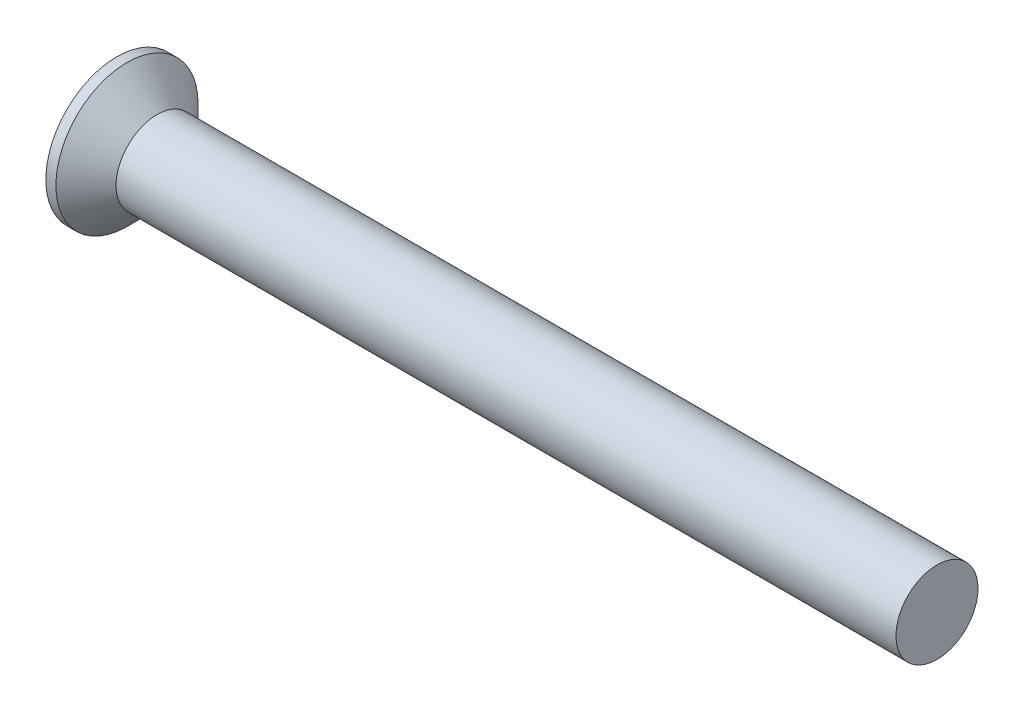
ISO-10303-21;
HEADER;
FILE_DESCRIPTION(('STEP AP214'),'2;1');
FILE_NAME('part.step','',(''),(''),'','','');
FILE_SCHEMA(('AUTOMOTIVE_DESIGN { 1 0 10303 214 1 1 1 1 }'));
ENDSEC;
DATA;
#1=APPLICATION_CONTEXT('core data for automotive mechanical design processes');
#2=APPLICATION_PROTOCOL_DEFINITION('international standard','automotive_design',2000,#1);
#3=PRODUCT_CONTEXT('',#1,'mechanical');
#4=PRODUCT('Part','Part','',(#3));
#5=PRODUCT_RELATED_PRODUCT_CATEGORY('part','',(#4));
#6=PRODUCT_DEFINITION_FORMATION('','',#4);
#7=PRODUCT_DEFINITION_CONTEXT('part definition',#1,'design');
#8=PRODUCT_DEFINITION('design','',#6,#7);
#9=PRODUCT_DEFINITION_SHAPE('','',#8);
#10=(LENGTH_UNIT() NAMED_UNIT(*) SI_UNIT(.MILLI.,.METRE.));
#11=(NAMED_UNIT(*) PLANE_ANGLE_UNIT() SI_UNIT($,.RADIAN.));
#12=(NAMED_UNIT(*) SI_UNIT($,.STERADIAN.) SOLID_ANGLE_UNIT());
#13=UNCERTAINTY_MEASURE_WITH_UNIT(LENGTH_MEASURE(1.E-05),#10,'distance_accuracy_value','');
#14=(GEOMETRIC_REPRESENTATION_CONTEXT(3) GLOBAL_UNCERTAINTY_ASSIGNED_CONTEXT((#13)) GLOBAL_UNIT_ASSIGNED_CONTEXT((#10,
#11,#12)) REPRESENTATION_CONTEXT('',''));
#15=CARTESIAN_POINT('',(0.,0.,0.));
#16=DIRECTION('',(0.,0.,1.));
#17=DIRECTION('',(1.,0.,0.));
#18=AXIS2_PLACEMENT_3D('',#15,#16,#17);
#19=CARTESIAN_POINT('',(30.,1.5,0.));
#20=DIRECTION('',(1.,0.,0.));
#21=DIRECTION('',(0.,0.,-1.));
#22=AXIS2_PLACEMENT_3D('',#19,#20,#21);
#23=PLANE('',#22);
#24=CARTESIAN_POINT('',(30.,0.,0.));
#25=DIRECTION('',(1.,0.,0.));
#26=DIRECTION('',(0.,0.,-1.));
#27=AXIS2_PLACEMENT_3D('',#24,#25,#26);
#28=CIRCLE('',#27,1.5);
#29=CARTESIAN_POINT('',(30.,0.,-1.5));
#30=VERTEX_POINT('',#29);
#31=EDGE_CURVE('E212',#30,#30,#28,.T.);
#32=ORIENTED_EDGE('',*,*,#31,.T.);
#33=EDGE_LOOP('',(#32));
#34=FACE_BOUND('',#33,.T.);
#35=ADVANCED_FACE('F39',(#34),#23,.T.);
#36=CARTESIAN_POINT('',(4.47857142857143,0.,0.));
#37=DIRECTION('',(0.,0.,1.));
#38=DIRECTION('',(1.,0.,0.));
#39=AXIS2_PLACEMENT_3D('',#36,#37,#38);
#40=SPHERICAL_SURFACE('',#39,5.17857142857143);
#41=CARTESIAN_POINT('',(4.47857142857143,-0.34,0.));
#42=DIRECTION('',(0.,-1.,0.));
#43=DIRECTION('',(0.,0.,-1.));
#44=AXIS2_PLACEMENT_3D('',#41,#42,#43);
#45=CIRCLE('',#44,5.16739799520187);
#46=CARTESIAN_POINT('',(-0.649040300178744,-0.34,0.64));
#47=VERTEX_POINT('',#46);
#48=CARTESIAN_POINT('',(-0.449236221463888,-0.34,1.55522146495917));
#49=VERTEX_POINT('',#48);
#50=EDGE_CURVE('E216',#47,#49,#45,.F.);
#51=ORIENTED_EDGE('',*,*,#50,.F.);
#52=CARTESIAN_POINT('',(-0.649040300178744,-0.34,0.64));
#53=CARTESIAN_POINT('',(-0.651125092654162,-0.339985289450023,0.623311452140583));
#54=CARTESIAN_POINT('',(-0.653033929290357,-0.341391829430021,0.606601424650036));
#55=CARTESIAN_POINT('',(-0.656452170050109,-0.346964127621354,0.5736121624894));
#56=CARTESIAN_POINT('',(-0.65796171829767,-0.351128888339867,0.557332774293918));
#57=CARTESIAN_POINT('',(-0.660536487111277,-0.362138947374793,0.525652873141929));
#58=CARTESIAN_POINT('',(-0.661601343834687,-0.368986431829208,0.510253088726624));
#59=CARTESIAN_POINT('',(-0.663252998096254,-0.385171176182099,0.480800931998128));
#60=CARTESIAN_POINT('',(-0.663839957231516,-0.394507593050013,0.466748105641541));
#61=CARTESIAN_POINT('',(-0.664515452071122,-0.415321472159786,0.4405062565739));
#62=CARTESIAN_POINT('',(-0.664608082666448,-0.426780527999705,0.428302737690038));
#63=CARTESIAN_POINT('',(-0.664303114987313,-0.451564797074484,0.405969181412248));
#64=CARTESIAN_POINT('',(-0.663905445161817,-0.464890282431521,0.395839446903564));
#65=CARTESIAN_POINT('',(-0.662634307516275,-0.492968256658572,0.37797394516552));
#66=CARTESIAN_POINT('',(-0.661762583572712,-0.507715353336348,0.370229565624028));
#67=CARTESIAN_POINT('',(-0.659570189800754,-0.538256524979789,0.357293431751204));
#68=CARTESIAN_POINT('',(-0.658249676480978,-0.554050233411554,0.352100789081599));
#69=CARTESIAN_POINT('',(-0.655638949519575,-0.58159529125856,0.345503933478422));
#70=CARTESIAN_POINT('',(-0.654449232328966,-0.593202962798242,0.343439686525628));
#71=CARTESIAN_POINT('',(-0.65188165405693,-0.616542796288321,0.34068755770359));
#72=CARTESIAN_POINT('',(-0.650504065142036,-0.628274755914445,0.339997706931737));
#73=CARTESIAN_POINT('',(-0.649040300178744,-0.64,0.34));
#74=B_SPLINE_CURVE_WITH_KNOTS('',3,(#52,#53,#54,#55,#56,#57,#58,#59,#60,#61,#62,#63,#64,#65,#66,
#67,#68,#69,#70,#71,#72,#73),.UNSPECIFIED.,.F.,.F.,(4,2,2,2,2,2,2,2,2,2,4),(0.,
0.0503945846133996,0.100770954293446,0.151188461094855,0.201588912545959,0.251571204016887,
0.301560790419327,0.351367714764633,0.401157287478689,0.436628333814892,0.472048529167462),.UNSPECIFIED.);
#75=CARTESIAN_POINT('',(-0.649040300178744,-0.64,0.34));
#76=VERTEX_POINT('',#75);
#77=EDGE_CURVE('E271',#47,#76,#74,.T.);
#78=ORIENTED_EDGE('',*,*,#77,.T.);
#79=CARTESIAN_POINT('',(4.47857142857143,0.,0.34));
#80=DIRECTION('',(0.,0.,1.));
#81=DIRECTION('',(1.,0.,0.));
#82=AXIS2_PLACEMENT_3D('',#79,#80,#81);
#83=CIRCLE('',#82,5.16739799520187);
#84=CARTESIAN_POINT('',(-0.449236221463888,-1.55522146495917,0.34));
#85=VERTEX_POINT('',#84);
#86=EDGE_CURVE('E190',#85,#76,#83,.F.);
#87=ORIENTED_EDGE('',*,*,#86,.F.);
#88=CARTESIAN_POINT('',(3.92005016464534,0.967387206227569,0.));
#89=DIRECTION('',(-0.500000000000001,0.866025403784438,0.));
#90=DIRECTION('',(-0.866025403784438,-0.500000000000001,0.));
#91=AXIS2_PLACEMENT_3D('',#88,#89,#90);
#92=CIRCLE('',#91,5.05666075901735);
#93=CARTESIAN_POINT('',(-0.449236221463888,-1.55522146495917,-0.339999999999999));
#94=VERTEX_POINT('',#93);
#95=EDGE_CURVE('E228',#94,#85,#92,.T.);
#96=ORIENTED_EDGE('',*,*,#95,.F.);
#97=CARTESIAN_POINT('',(4.47857142857143,0.,-0.34));
#98=DIRECTION('',(0.,0.,-1.));
#99=DIRECTION('',(0.,1.,0.));
#100=AXIS2_PLACEMENT_3D('',#97,#98,#99);
#101=CIRCLE('',#100,5.16739799520187);
#102=CARTESIAN_POINT('',(-0.649040300178744,-0.64,-0.34));
#103=VERTEX_POINT('',#102);
#104=EDGE_CURVE('E184',#103,#94,#101,.F.);
#105=ORIENTED_EDGE('',*,*,#104,.F.);
#106=CARTESIAN_POINT('',(-0.649040300178744,-0.64,-0.34));
#107=CARTESIAN_POINT('',(-0.651125092654162,-0.623311452140583,-0.339985289450022));
#108=CARTESIAN_POINT('',(-0.653033929290357,-0.606601424650036,-0.34139182943002));
#109=CARTESIAN_POINT('',(-0.656452170050109,-0.5736121624894,-0.346964127621354));
#110=CARTESIAN_POINT('',(-0.65796171829767,-0.557332774293918,-0.351128888339867));
#111=CARTESIAN_POINT('',(-0.660536487111277,-0.525652873141929,-0.362138947374792));
#112=CARTESIAN_POINT('',(-0.661601343834687,-0.510253088726624,-0.368986431829208));
#113=CARTESIAN_POINT('',(-0.663252998096254,-0.480800931998128,-0.385171176182099));
#114=CARTESIAN_POINT('',(-0.663839957231516,-0.466748105641541,-0.394507593050013));
#115=CARTESIAN_POINT('',(-0.664515452071122,-0.4405062565739,-0.415321472159785));
#116=CARTESIAN_POINT('',(-0.664608082666448,-0.428302737690037,-0.426780527999705));
#117=CARTESIAN_POINT('',(-0.664303114987313,-0.405969181412248,-0.451564797074484));
#118=CARTESIAN_POINT('',(-0.663905445161817,-0.395839446903564,-0.464890282431521));
#119=CARTESIAN_POINT('',(-0.662634307516275,-0.37797394516552,-0.492968256658571));
#120=CARTESIAN_POINT('',(-0.661762583572712,-0.370229565624028,-0.507715353336347));
#121=CARTESIAN_POINT('',(-0.659570189800754,-0.357293431751204,-0.538256524979788));
#122=CARTESIAN_POINT('',(-0.658249676480978,-0.352100789081599,-0.554050233411553));
#123=CARTESIAN_POINT('',(-0.655638949519575,-0.345503933478422,-0.581595291258559));
#124=CARTESIAN_POINT('',(-0.654449232328966,-0.343439686525628,-0.593202962798242));
#125=CARTESIAN_POINT('',(-0.651881654056929,-0.34068755770359,-0.61654279628832));
#126=CARTESIAN_POINT('',(-0.650504065142036,-0.339997706931737,-0.628274755914444));
#127=CARTESIAN_POINT('',(-0.649040300178744,-0.34,-0.64));
#128=B_SPLINE_CURVE_WITH_KNOTS('',3,(#106,#107,#108,#109,#110,#111,#112,#113,#114,#115,#116,
#117,#118,#119,#120,#121,#122,#123,#124,#125,#126,#127),.UNSPECIFIED.,.F.,.F.,(4,2,2,2,2,2,2,2,
2,2,4),(0.,0.0503945846133996,0.100770954293446,0.151188461094856,0.201588912545959,
0.251571204016887,0.301560790419327,0.351367714764633,0.401157287478689,0.436628333814892,
0.472048529167462),.UNSPECIFIED.);
#129=CARTESIAN_POINT('',(-0.649040300178744,-0.34,-0.64));
#130=VERTEX_POINT('',#129);
#131=EDGE_CURVE('E265',#103,#130,#128,.T.);
#132=ORIENTED_EDGE('',*,*,#131,.T.);
#133=CARTESIAN_POINT('',(4.47857142857143,-0.34,0.));
#134=DIRECTION('',(0.,-1.,0.));
#135=DIRECTION('',(0.,0.,-1.));
#136=AXIS2_PLACEMENT_3D('',#133,#134,#135);
#137=CIRCLE('',#136,5.16739799520187);
#138=CARTESIAN_POINT('',(-0.449236221463888,-0.34,-1.55522146495917));
#139=VERTEX_POINT('',#138);
#140=EDGE_CURVE('E181',#139,#130,#137,.F.);
#141=ORIENTED_EDGE('',*,*,#140,.F.);
#142=CARTESIAN_POINT('',(3.92005016464534,0.,0.967387206227569));
#143=DIRECTION('',(-0.500000000000001,0.,0.866025403784438));
#144=DIRECTION('',(0.866025403784438,0.,0.500000000000001));
#145=AXIS2_PLACEMENT_3D('',#142,#143,#144);
#146=CIRCLE('',#145,5.05666075901735);
#147=CARTESIAN_POINT('',(-0.449236221463888,0.34,-1.55522146495917));
#148=VERTEX_POINT('',#147);
#149=EDGE_CURVE('E169',#148,#139,#146,.T.);
#150=ORIENTED_EDGE('',*,*,#149,.F.);
#151=CARTESIAN_POINT('',(4.47857142857143,0.34,0.));
#152=DIRECTION('',(0.,1.,0.));
#153=DIRECTION('',(0.,0.,1.));
#154=AXIS2_PLACEMENT_3D('',#151,#152,#153);
#155=CIRCLE('',#154,5.16739799520187);
#156=CARTESIAN_POINT('',(-0.649040300178744,0.34,-0.64));
#157=VERTEX_POINT('',#156);
#158=EDGE_CURVE('E154',#157,#148,#155,.F.);
#159=ORIENTED_EDGE('',*,*,#158,.F.);
#160=CARTESIAN_POINT('',(-0.649040300178744,0.34,-0.64));
#161=CARTESIAN_POINT('',(-0.651125092654162,0.339985289450023,-0.623311452140583));
#162=CARTESIAN_POINT('',(-0.653033929290357,0.34139182943002,-0.606601424650036));
#163=CARTESIAN_POINT('',(-0.656452170050109,0.346964127621354,-0.5736121624894));
#164=CARTESIAN_POINT('',(-0.65796171829767,0.351128888339867,-0.557332774293918));
#165=CARTESIAN_POINT('',(-0.660536487111277,0.362138947374792,-0.525652873141928));
#166=CARTESIAN_POINT('',(-0.661601343834687,0.368986431829208,-0.510253088726624));
#167=CARTESIAN_POINT('',(-0.663252998096254,0.385171176182099,-0.480800931998128));
#168=CARTESIAN_POINT('',(-0.663839957231516,0.394507593050013,-0.466748105641541));
#169=CARTESIAN_POINT('',(-0.664515452071122,0.415321472159785,-0.4405062565739));
#170=CARTESIAN_POINT('',(-0.664608082666448,0.426780527999705,-0.428302737690037));
#171=CARTESIAN_POINT('',(-0.664303114987313,0.451564797074484,-0.405969181412247));
#172=CARTESIAN_POINT('',(-0.663905445161817,0.464890282431521,-0.395839446903564));
#173=CARTESIAN_POINT('',(-0.662634307516275,0.492968256658572,-0.37797394516552));
#174=CARTESIAN_POINT('',(-0.661762583572712,0.507715353336347,-0.370229565624028));
#175=CARTESIAN_POINT('',(-0.659570189800754,0.538256524979789,-0.357293431751204));
#176=CARTESIAN_POINT('',(-0.658249676480978,0.554050233411553,-0.352100789081598));
#177=CARTESIAN_POINT('',(-0.655638949519575,0.581595291258559,-0.345503933478422));
#178=CARTESIAN_POINT('',(-0.654449232328966,0.593202962798242,-0.343439686525628));
#179=CARTESIAN_POINT('',(-0.651881654056929,0.616542796288321,-0.34068755770359));
#180=CARTESIAN_POINT('',(-0.650504065142036,0.628274755914444,-0.339997706931736));
#181=CARTESIAN_POINT('',(-0.649040300178744,0.64,-0.34));
#182=B_SPLINE_CURVE_WITH_KNOTS('',3,(#160,#161,#162,#163,#164,#165,#166,#167,#168,#169,#170,
#171,#172,#173,#174,#175,#176,#177,#178,#179,#180,#181),.UNSPECIFIED.,.F.,.F.,(4,2,2,2,2,2,2,2,
2,2,4),(0.,0.0503945846133996,0.100770954293446,0.151188461094856,0.201588912545959,
0.251571204016887,0.301560790419327,0.351367714764633,0.401157287478689,0.436628333814892,
0.472048529167462),.UNSPECIFIED.);
#183=CARTESIAN_POINT('',(-0.649040300178744,0.64,-0.34));
#184=VERTEX_POINT('',#183);
#185=EDGE_CURVE('E248',#157,#184,#182,.T.);
#186=ORIENTED_EDGE('',*,*,#185,.T.);
#187=CARTESIAN_POINT('',(4.47857142857143,0.,-0.34));
#188=DIRECTION('',(0.,0.,-1.));
#189=DIRECTION('',(0.,1.,0.));
#190=AXIS2_PLACEMENT_3D('',#187,#188,#189);
#191=CIRCLE('',#190,5.16739799520187);
#192=CARTESIAN_POINT('',(-0.449236221463888,1.55522146495917,-0.34));
#193=VERTEX_POINT('',#192);
#194=EDGE_CURVE('E165',#193,#184,#191,.F.);
#195=ORIENTED_EDGE('',*,*,#194,.F.);
#196=CARTESIAN_POINT('',(3.92005016464534,-0.967387206227569,0.));
#197=DIRECTION('',(-0.500000000000001,-0.866025403784438,0.));
#198=DIRECTION('',(0.866025403784438,-0.500000000000001,0.));
#199=AXIS2_PLACEMENT_3D('',#196,#197,#198);
#200=CIRCLE('',#199,5.05666075901735);
#201=CARTESIAN_POINT('',(-0.449236221463888,1.55522146495917,0.34));
#202=VERTEX_POINT('',#201);
#203=EDGE_CURVE('E198',#202,#193,#200,.T.);
#204=ORIENTED_EDGE('',*,*,#203,.F.);
#205=CARTESIAN_POINT('',(4.47857142857143,0.,0.34));
#206=DIRECTION('',(0.,0.,1.));
#207=DIRECTION('',(1.,0.,0.));
#208=AXIS2_PLACEMENT_3D('',#205,#206,#207);
#209=CIRCLE('',#208,5.16739799520187);
#210=CARTESIAN_POINT('',(-0.649040300178744,0.64,0.34));
#211=VERTEX_POINT('',#210);
#212=EDGE_CURVE('E200',#211,#202,#209,.F.);
#213=ORIENTED_EDGE('',*,*,#212,.F.);
#214=CARTESIAN_POINT('',(-0.649040300178744,0.64,0.34));
#215=CARTESIAN_POINT('',(-0.651125092654162,0.623311452140583,0.339985289450023));
#216=CARTESIAN_POINT('',(-0.653033929290357,0.606601424650036,0.341391829430021));
#217=CARTESIAN_POINT('',(-0.656452170050109,0.5736121624894,0.346964127621354));
#218=CARTESIAN_POINT('',(-0.65796171829767,0.557332774293918,0.351128888339867));
#219=CARTESIAN_POINT('',(-0.660536487111277,0.525652873141929,0.362138947374793));
#220=CARTESIAN_POINT('',(-0.661601343834687,0.510253088726624,0.368986431829208));
#221=CARTESIAN_POINT('',(-0.663252998096254,0.480800931998128,0.3851711761821));
#222=CARTESIAN_POINT('',(-0.663839957231516,0.466748105641541,0.394507593050013));
#223=CARTESIAN_POINT('',(-0.664515452071122,0.4405062565739,0.415321472159786));
#224=CARTESIAN_POINT('',(-0.664608082666448,0.428302737690037,0.426780527999705));
#225=CARTESIAN_POINT('',(-0.664303114987313,0.405969181412248,0.451564797074485));
#226=CARTESIAN_POINT('',(-0.663905445161817,0.395839446903564,0.464890282431521));
#227=CARTESIAN_POINT('',(-0.662634307516275,0.37797394516552,0.492968256658572));
#228=CARTESIAN_POINT('',(-0.661762583572712,0.370229565624028,0.507715353336348));
#229=CARTESIAN_POINT('',(-0.659570189800754,0.357293431751204,0.538256524979789));
#230=CARTESIAN_POINT('',(-0.658249676480978,0.352100789081599,0.554050233411554));
#231=CARTESIAN_POINT('',(-0.655638949519575,0.345503933478422,0.58159529125856));
#232=CARTESIAN_POINT('',(-0.654449232328966,0.343439686525628,0.593202962798242));
#233=CARTESIAN_POINT('',(-0.65188165405693,0.34068755770359,0.616542796288321));
#234=CARTESIAN_POINT('',(-0.650504065142036,0.339997706931736,0.628274755914445));
#235=CARTESIAN_POINT('',(-0.649040300178744,0.34,0.64));
#236=B_SPLINE_CURVE_WITH_KNOTS('',3,(#214,#215,#216,#217,#218,#219,#220,#221,#222,#223,#224,
#225,#226,#227,#228,#229,#230,#231,#232,#233,#234,#235),.UNSPECIFIED.,.F.,.F.,(4,2,2,2,2,2,2,2,
2,2,4),(0.,0.0503945846133996,0.100770954293446,0.151188461094855,0.201588912545959,
0.251571204016887,0.301560790419327,0.351367714764633,0.401157287478689,0.436628333814892,
0.472048529167462),.UNSPECIFIED.);
#237=CARTESIAN_POINT('',(-0.649040300178744,0.34,0.64));
#238=VERTEX_POINT('',#237);
#239=EDGE_CURVE('E241',#211,#238,#236,.T.);
#240=ORIENTED_EDGE('',*,*,#239,.T.);
#241=CARTESIAN_POINT('',(4.47857142857143,0.34,0.));
#242=DIRECTION('',(0.,1.,0.));
#243=DIRECTION('',(0.,0.,1.));
#244=AXIS2_PLACEMENT_3D('',#241,#242,#243);
#245=CIRCLE('',#244,5.16739799520187);
#246=CARTESIAN_POINT('',(-0.449236221463888,0.34,1.55522146495917));
#247=VERTEX_POINT('',#246);
#248=EDGE_CURVE('E215',#247,#238,#245,.F.);
#249=ORIENTED_EDGE('',*,*,#248,.F.);
#250=CARTESIAN_POINT('',(3.92005016464534,0.,-0.967387206227568));
#251=DIRECTION('',(-0.500000000000001,0.,-0.866025403784438));
#252=DIRECTION('',(-0.866025403784438,0.,0.500000000000001));
#253=AXIS2_PLACEMENT_3D('',#250,#251,#252);
#254=CIRCLE('',#253,5.05666075901735);
#255=EDGE_CURVE('E213',#49,#247,#254,.T.);
#256=ORIENTED_EDGE('',*,*,#255,.F.);
#257=EDGE_LOOP('',(#51,#78,#87,#96,#105,#132,#141,#150,#159,#186,#195,#204,#213,#240,#249,#256));
#258=FACE_BOUND('',#257,.T.);
#259=CARTESIAN_POINT('',(0.,0.,0.));
#260=DIRECTION('',(1.,0.,0.));
#261=DIRECTION('',(0.,0.,-1.));
#262=AXIS2_PLACEMENT_3D('',#259,#260,#261);
#263=CIRCLE('',#262,2.6);
#264=CARTESIAN_POINT('',(0.,0.,-2.6));
#265=VERTEX_POINT('',#264);
#266=EDGE_CURVE('E182',#265,#265,#263,.T.);
#267=ORIENTED_EDGE('',*,*,#266,.F.);
#268=EDGE_LOOP('',(#267));
#269=FACE_BOUND('',#268,.T.);
#270=ADVANCED_FACE('F178',(#258,#269),#40,.T.);
#271=CARTESIAN_POINT('',(4.51581291088132,0.,0.));
#272=DIRECTION('',(1.,0.,0.));
#273=DIRECTION('',(0.,0.,-1.));
#274=AXIS2_PLACEMENT_3D('',#271,#272,#273);
#275=CYLINDRICAL_SURFACE('',#274,2.6);
#276=ORIENTED_EDGE('',*,*,#266,.T.);
#277=EDGE_LOOP('',(#276));
#278=FACE_BOUND('',#277,.T.);
#279=CARTESIAN_POINT('',(0.367367965644039,0.,0.));
#280=DIRECTION('',(1.,0.,0.));
#281=DIRECTION('',(0.,0.,-1.));
#282=AXIS2_PLACEMENT_3D('',#279,#280,#281);
#283=CIRCLE('',#282,2.6);
#284=CARTESIAN_POINT('',(0.367367965644039,0.,-2.6));
#285=VERTEX_POINT('',#284);
#286=EDGE_CURVE('E187',#285,#285,#283,.T.);
#287=ORIENTED_EDGE('',*,*,#286,.F.);
#288=EDGE_LOOP('',(#287));
#289=FACE_BOUND('',#288,.T.);
#290=ADVANCED_FACE('F258',(#278,#289),#275,.T.);
#291=CARTESIAN_POINT('',(1.46736796564404,0.,0.));
#292=DIRECTION('',(-1.,0.,0.));
#293=DIRECTION('',(0.,0.,1.));
#294=AXIS2_PLACEMENT_3D('',#291,#292,#293);
#295=CONICAL_SURFACE('',#294,1.5,0.78539816339745);
#296=ORIENTED_EDGE('',*,*,#286,.T.);
#297=EDGE_LOOP('',(#296));
#298=FACE_BOUND('',#297,.T.);
#299=CARTESIAN_POINT('',(1.46736796564404,0.,0.));
#300=DIRECTION('',(1.,0.,0.));
#301=DIRECTION('',(0.,0.,-1.));
#302=AXIS2_PLACEMENT_3D('',#299,#300,#301);
#303=CIRCLE('',#302,1.5);
#304=CARTESIAN_POINT('',(1.46736796564404,0.,-1.5));
#305=VERTEX_POINT('',#304);
#306=EDGE_CURVE('E301',#305,#305,#303,.T.);
#307=ORIENTED_EDGE('',*,*,#306,.F.);
#308=EDGE_LOOP('',(#307));
#309=FACE_BOUND('',#308,.T.);
#310=ADVANCED_FACE('F403',(#298,#309),#295,.T.);
#311=CARTESIAN_POINT('',(4.51581291088132,0.,0.));
#312=DIRECTION('',(1.,0.,0.));
#313=DIRECTION('',(0.,0.,-1.));
#314=AXIS2_PLACEMENT_3D('',#311,#312,#313);
#315=CYLINDRICAL_SURFACE('',#314,1.5);
#316=ORIENTED_EDGE('',*,*,#306,.T.);
#317=EDGE_LOOP('',(#316));
#318=FACE_BOUND('',#317,.T.);
#319=ORIENTED_EDGE('',*,*,#31,.F.);
#320=EDGE_LOOP('',(#319));
#321=FACE_BOUND('',#320,.T.);
#322=ADVANCED_FACE('F400',(#318,#321),#315,.T.);
#323=CARTESIAN_POINT('',(0.125,0.34,-0.34));
#324=DIRECTION('',(0.,1.,0.));
#325=DIRECTION('',(0.,0.,1.));
#326=AXIS2_PLACEMENT_3D('',#323,#324,#325);
#327=PLANE('',#326);
#328=DIRECTION('',(0.,0.,-1.));
#329=VECTOR('',#328,1.);
#330=CARTESIAN_POINT('',(0.125,0.34,-0.34));
#331=LINE('',#330,#329);
#332=CARTESIAN_POINT('',(0.125,0.34,-0.64));
#333=VERTEX_POINT('',#332);
#334=CARTESIAN_POINT('',(0.125,0.34,-1.22368602791856));
#335=VERTEX_POINT('',#334);
#336=EDGE_CURVE('E195',#333,#335,#331,.T.);
#337=ORIENTED_EDGE('',*,*,#336,.F.);
#338=DIRECTION('',(-1.,0.,0.));
#339=VECTOR('',#338,1.);
#340=CARTESIAN_POINT('',(0.125,0.34,-0.64));
#341=LINE('',#340,#339);
#342=EDGE_CURVE('E161',#333,#157,#341,.T.);
#343=ORIENTED_EDGE('',*,*,#342,.T.);
#344=ORIENTED_EDGE('',*,*,#158,.T.);
#345=DIRECTION('',(0.866025403784438,0.,0.500000000000001));
#346=VECTOR('',#345,1.);
#347=CARTESIAN_POINT('',(0.507647274573418,0.34,-1.00276452093892));
#348=LINE('',#347,#346);
#349=EDGE_CURVE('E158',#335,#148,#348,.F.);
#350=ORIENTED_EDGE('',*,*,#349,.F.);
#351=EDGE_LOOP('',(#337,#343,#344,#350));
#352=FACE_BOUND('',#351,.T.);
#353=ADVANCED_FACE('F157',(#352),#327,.F.);
#354=CARTESIAN_POINT('',(0.125,0.34,-0.34));
#355=DIRECTION('',(0.,0.,-1.));
#356=DIRECTION('',(0.,1.,0.));
#357=AXIS2_PLACEMENT_3D('',#354,#355,#356);
#358=PLANE('',#357);
#359=ORIENTED_EDGE('',*,*,#194,.T.);
#360=DIRECTION('',(-1.,0.,0.));
#361=VECTOR('',#360,1.);
#362=CARTESIAN_POINT('',(0.125,0.64,-0.34));
#363=LINE('',#362,#361);
#364=CARTESIAN_POINT('',(0.125,0.64,-0.34));
#365=VERTEX_POINT('',#364);
#366=EDGE_CURVE('E343',#184,#365,#363,.F.);
#367=ORIENTED_EDGE('',*,*,#366,.T.);
#368=DIRECTION('',(0.,-1.,0.));
#369=VECTOR('',#368,1.);
#370=CARTESIAN_POINT('',(0.125,0.34,-0.34));
#371=LINE('',#370,#369);
#372=CARTESIAN_POINT('',(0.125,1.22368602791856,-0.34));
#373=VERTEX_POINT('',#372);
#374=EDGE_CURVE('E174',#373,#365,#371,.T.);
#375=ORIENTED_EDGE('',*,*,#374,.F.);
#376=DIRECTION('',(0.866025403784438,-0.500000000000001,0.));
#377=VECTOR('',#376,1.);
#378=CARTESIAN_POINT('',(-0.7,1.7,-0.34));
#379=LINE('',#378,#377);
#380=EDGE_CURVE('E204',#373,#193,#379,.F.);
#381=ORIENTED_EDGE('',*,*,#380,.T.);
#382=EDGE_LOOP('',(#359,#367,#375,#381));
#383=FACE_BOUND('',#382,.T.);
#384=ADVANCED_FACE('F359',(#383),#358,.F.);
#385=CARTESIAN_POINT('',(-0.7,1.7,0.));
#386=DIRECTION('',(-0.500000000000001,-0.866025403784438,0.));
#387=DIRECTION('',(0.866025403784438,-0.500000000000001,0.));
#388=AXIS2_PLACEMENT_3D('',#385,#386,#387);
#389=PLANE('',#388);
#390=ORIENTED_EDGE('',*,*,#203,.T.);
#391=ORIENTED_EDGE('',*,*,#380,.F.);
#392=DIRECTION('',(0.,0.,1.));
#393=VECTOR('',#392,1.);
#394=CARTESIAN_POINT('',(0.125,1.22368602791856,-0.34));
#395=LINE('',#394,#393);
#396=CARTESIAN_POINT('',(0.125,1.22368602791856,0.34));
#397=VERTEX_POINT('',#396);
#398=EDGE_CURVE('E206',#397,#373,#395,.F.);
#399=ORIENTED_EDGE('',*,*,#398,.F.);
#400=DIRECTION('',(0.866025403784438,-0.500000000000001,0.));
#401=VECTOR('',#400,1.);
#402=CARTESIAN_POINT('',(0.507647274573418,1.00276452093892,0.34));
#403=LINE('',#402,#401);
#404=EDGE_CURVE('E201',#397,#202,#403,.F.);
#405=ORIENTED_EDGE('',*,*,#404,.T.);
#406=EDGE_LOOP('',(#390,#391,#399,#405));
#407=FACE_BOUND('',#406,.T.);
#408=ADVANCED_FACE('F362',(#407),#389,.T.);
#409=CARTESIAN_POINT('',(0.125,0.34,0.34));
#410=DIRECTION('',(0.,0.,1.));
#411=DIRECTION('',(1.,0.,0.));
#412=AXIS2_PLACEMENT_3D('',#409,#410,#411);
#413=PLANE('',#412);
#414=DIRECTION('',(0.,1.,0.));
#415=VECTOR('',#414,1.);
#416=CARTESIAN_POINT('',(0.125,0.34,0.34));
#417=LINE('',#416,#415);
#418=CARTESIAN_POINT('',(0.125,0.64,0.34));
#419=VERTEX_POINT('',#418);
#420=EDGE_CURVE('E209',#419,#397,#417,.T.);
#421=ORIENTED_EDGE('',*,*,#420,.F.);
#422=DIRECTION('',(-1.,0.,0.));
#423=VECTOR('',#422,1.);
#424=CARTESIAN_POINT('',(0.125,0.64,0.34));
#425=LINE('',#424,#423);
#426=EDGE_CURVE('E345',#419,#211,#425,.T.);
#427=ORIENTED_EDGE('',*,*,#426,.T.);
#428=ORIENTED_EDGE('',*,*,#212,.T.);
#429=ORIENTED_EDGE('',*,*,#404,.F.);
#430=EDGE_LOOP('',(#421,#427,#428,#429));
#431=FACE_BOUND('',#430,.T.);
#432=ADVANCED_FACE('F366',(#431),#413,.F.);
#433=CARTESIAN_POINT('',(0.125,0.34,0.34));
#434=DIRECTION('',(0.,1.,0.));
#435=DIRECTION('',(0.,0.,1.));
#436=AXIS2_PLACEMENT_3D('',#433,#434,#435);
#437=PLANE('',#436);
#438=ORIENTED_EDGE('',*,*,#248,.T.);
#439=DIRECTION('',(-1.,0.,0.));
#440=VECTOR('',#439,1.);
#441=CARTESIAN_POINT('',(0.125,0.34,0.64));
#442=LINE('',#441,#440);
#443=CARTESIAN_POINT('',(0.125,0.34,0.64));
#444=VERTEX_POINT('',#443);
#445=EDGE_CURVE('E55',#238,#444,#442,.F.);
#446=ORIENTED_EDGE('',*,*,#445,.T.);
#447=DIRECTION('',(0.,0.,-1.));
#448=VECTOR('',#447,1.);
#449=CARTESIAN_POINT('',(0.125,0.34,0.34));
#450=LINE('',#449,#448);
#451=CARTESIAN_POINT('',(0.125,0.34,1.22368602791856));
#452=VERTEX_POINT('',#451);
#453=EDGE_CURVE('E224',#452,#444,#450,.T.);
#454=ORIENTED_EDGE('',*,*,#453,.F.);
#455=DIRECTION('',(0.866025403784438,0.,-0.500000000000001));
#456=VECTOR('',#455,1.);
#457=CARTESIAN_POINT('',(-0.7,0.34,1.7));
#458=LINE('',#457,#456);
#459=EDGE_CURVE('E205',#452,#247,#458,.F.);
#460=ORIENTED_EDGE('',*,*,#459,.T.);
#461=EDGE_LOOP('',(#438,#446,#454,#460));
#462=FACE_BOUND('',#461,.T.);
#463=ADVANCED_FACE('F370',(#462),#437,.F.);
#464=CARTESIAN_POINT('',(-0.7,0.,1.7));
#465=DIRECTION('',(-0.500000000000001,0.,-0.866025403784438));
#466=DIRECTION('',(-0.866025403784438,0.,0.500000000000001));
#467=AXIS2_PLACEMENT_3D('',#464,#465,#466);
#468=PLANE('',#467);
#469=ORIENTED_EDGE('',*,*,#255,.T.);
#470=ORIENTED_EDGE('',*,*,#459,.F.);
#471=DIRECTION('',(0.,-1.,0.));
#472=VECTOR('',#471,1.);
#473=CARTESIAN_POINT('',(0.125,0.34,1.22368602791856));
#474=LINE('',#473,#472);
#475=CARTESIAN_POINT('',(0.125,-0.34,1.22368602791856));
#476=VERTEX_POINT('',#475);
#477=EDGE_CURVE('E221',#476,#452,#474,.F.);
#478=ORIENTED_EDGE('',*,*,#477,.F.);
#479=DIRECTION('',(0.866025403784438,0.,-0.500000000000001));
#480=VECTOR('',#479,1.);
#481=CARTESIAN_POINT('',(0.507647274573418,-0.34,1.00276452093892));
#482=LINE('',#481,#480);
#483=EDGE_CURVE('E217',#476,#49,#482,.F.);
#484=ORIENTED_EDGE('',*,*,#483,.T.);
#485=EDGE_LOOP('',(#469,#470,#478,#484));
#486=FACE_BOUND('',#485,.T.);
#487=ADVANCED_FACE('F373',(#486),#468,.T.);
#488=CARTESIAN_POINT('',(0.125,-0.34,0.34));
#489=DIRECTION('',(0.,-1.,0.));
#490=DIRECTION('',(0.,0.,-1.));
#491=AXIS2_PLACEMENT_3D('',#488,#489,#490);
#492=PLANE('',#491);
#493=DIRECTION('',(0.,0.,1.));
#494=VECTOR('',#493,1.);
#495=CARTESIAN_POINT('',(0.125,-0.34,0.34));
#496=LINE('',#495,#494);
#497=CARTESIAN_POINT('',(0.125,-0.34,0.64));
#498=VERTEX_POINT('',#497);
#499=EDGE_CURVE('E225',#498,#476,#496,.T.);
#500=ORIENTED_EDGE('',*,*,#499,.F.);
#501=DIRECTION('',(-1.,0.,0.));
#502=VECTOR('',#501,1.);
#503=CARTESIAN_POINT('',(0.125,-0.34,0.64));
#504=LINE('',#503,#502);
#505=EDGE_CURVE('E164',#498,#47,#504,.T.);
#506=ORIENTED_EDGE('',*,*,#505,.T.);
#507=ORIENTED_EDGE('',*,*,#50,.T.);
#508=ORIENTED_EDGE('',*,*,#483,.F.);
#509=EDGE_LOOP('',(#500,#506,#507,#508));
#510=FACE_BOUND('',#509,.T.);
#511=ADVANCED_FACE('F377',(#510),#492,.F.);
#512=CARTESIAN_POINT('',(0.125,-0.34,0.34));
#513=DIRECTION('',(0.,0.,1.));
#514=DIRECTION('',(1.,0.,0.));
#515=AXIS2_PLACEMENT_3D('',#512,#513,#514);
#516=PLANE('',#515);
#517=ORIENTED_EDGE('',*,*,#86,.T.);
#518=DIRECTION('',(-1.,0.,0.));
#519=VECTOR('',#518,1.);
#520=CARTESIAN_POINT('',(0.125,-0.64,0.34));
#521=LINE('',#520,#519);
#522=CARTESIAN_POINT('',(0.125,-0.64,0.34));
#523=VERTEX_POINT('',#522);
#524=EDGE_CURVE('E332',#76,#523,#521,.F.);
#525=ORIENTED_EDGE('',*,*,#524,.T.);
#526=DIRECTION('',(0.,1.,0.));
#527=VECTOR('',#526,1.);
#528=CARTESIAN_POINT('',(0.125,-0.34,0.34));
#529=LINE('',#528,#527);
#530=CARTESIAN_POINT('',(0.125,-1.22368602791856,0.34));
#531=VERTEX_POINT('',#530);
#532=EDGE_CURVE('E235',#531,#523,#529,.T.);
#533=ORIENTED_EDGE('',*,*,#532,.F.);
#534=DIRECTION('',(0.866025403784438,0.500000000000001,0.));
#535=VECTOR('',#534,1.);
#536=CARTESIAN_POINT('',(-0.7,-1.7,0.34));
#537=LINE('',#536,#535);
#538=EDGE_CURVE('E220',#531,#85,#537,.F.);
#539=ORIENTED_EDGE('',*,*,#538,.T.);
#540=EDGE_LOOP('',(#517,#525,#533,#539));
#541=FACE_BOUND('',#540,.T.);
#542=ADVANCED_FACE('F330',(#541),#516,.F.);
#543=CARTESIAN_POINT('',(-0.7,-1.7,0.));
#544=DIRECTION('',(-0.500000000000001,0.866025403784438,0.));
#545=DIRECTION('',(-0.866025403784438,-0.500000000000001,0.));
#546=AXIS2_PLACEMENT_3D('',#543,#544,#545);
#547=PLANE('',#546);
#548=ORIENTED_EDGE('',*,*,#95,.T.);
#549=ORIENTED_EDGE('',*,*,#538,.F.);
#550=DIRECTION('',(0.,0.,-1.));
#551=VECTOR('',#550,1.);
#552=CARTESIAN_POINT('',(0.125,-1.22368602791856,-0.34));
#553=LINE('',#552,#551);
#554=CARTESIAN_POINT('',(0.125,-1.22368602791856,-0.339999999999999));
#555=VERTEX_POINT('',#554);
#556=EDGE_CURVE('E232',#555,#531,#553,.F.);
#557=ORIENTED_EDGE('',*,*,#556,.F.);
#558=DIRECTION('',(0.866025403784438,0.500000000000001,0.));
#559=VECTOR('',#558,1.);
#560=CARTESIAN_POINT('',(0.507647274573418,-1.00276452093892,-0.339999999999999));
#561=LINE('',#560,#559);
#562=EDGE_CURVE('E197',#555,#94,#561,.F.);
#563=ORIENTED_EDGE('',*,*,#562,.T.);
#564=EDGE_LOOP('',(#548,#549,#557,#563));
#565=FACE_BOUND('',#564,.T.);
#566=ADVANCED_FACE('F325',(#565),#547,.T.);
#567=CARTESIAN_POINT('',(0.125,-0.34,-0.34));
#568=DIRECTION('',(0.,0.,-1.));
#569=DIRECTION('',(0.,1.,0.));
#570=AXIS2_PLACEMENT_3D('',#567,#568,#569);
#571=PLANE('',#570);
#572=DIRECTION('',(0.,-1.,0.));
#573=VECTOR('',#572,1.);
#574=CARTESIAN_POINT('',(0.125,-0.34,-0.34));
#575=LINE('',#574,#573);
#576=CARTESIAN_POINT('',(0.125,-0.64,-0.34));
#577=VERTEX_POINT('',#576);
#578=EDGE_CURVE('E236',#577,#555,#575,.T.);
#579=ORIENTED_EDGE('',*,*,#578,.F.);
#580=DIRECTION('',(-1.,0.,0.));
#581=VECTOR('',#580,1.);
#582=CARTESIAN_POINT('',(0.125,-0.64,-0.34));
#583=LINE('',#582,#581);
#584=EDGE_CURVE('E322',#577,#103,#583,.T.);
#585=ORIENTED_EDGE('',*,*,#584,.T.);
#586=ORIENTED_EDGE('',*,*,#104,.T.);
#587=ORIENTED_EDGE('',*,*,#562,.F.);
#588=EDGE_LOOP('',(#579,#585,#586,#587));
#589=FACE_BOUND('',#588,.T.);
#590=ADVANCED_FACE('F319',(#589),#571,.F.);
#591=CARTESIAN_POINT('',(0.125,-0.34,-0.34));
#592=DIRECTION('',(0.,-1.,0.));
#593=DIRECTION('',(0.,0.,-1.));
#594=AXIS2_PLACEMENT_3D('',#591,#592,#593);
#595=PLANE('',#594);
#596=ORIENTED_EDGE('',*,*,#140,.T.);
#597=DIRECTION('',(-1.,0.,0.));
#598=VECTOR('',#597,1.);
#599=CARTESIAN_POINT('',(0.125,-0.34,-0.64));
#600=LINE('',#599,#598);
#601=CARTESIAN_POINT('',(0.125,-0.34,-0.64));
#602=VERTEX_POINT('',#601);
#603=EDGE_CURVE('E338',#130,#602,#600,.F.);
#604=ORIENTED_EDGE('',*,*,#603,.T.);
#605=DIRECTION('',(0.,0.,1.));
#606=VECTOR('',#605,1.);
#607=CARTESIAN_POINT('',(0.125,-0.34,-0.34));
#608=LINE('',#607,#606);
#609=CARTESIAN_POINT('',(0.125,-0.34,-1.22368602791856));
#610=VERTEX_POINT('',#609);
#611=EDGE_CURVE('E194',#610,#602,#608,.T.);
#612=ORIENTED_EDGE('',*,*,#611,.F.);
#613=DIRECTION('',(0.866025403784438,0.,0.500000000000001));
#614=VECTOR('',#613,1.);
#615=CARTESIAN_POINT('',(-0.7,-0.34,-1.7));
#616=LINE('',#615,#614);
#617=EDGE_CURVE('E173',#610,#139,#616,.F.);
#618=ORIENTED_EDGE('',*,*,#617,.T.);
#619=EDGE_LOOP('',(#596,#604,#612,#618));
#620=FACE_BOUND('',#619,.T.);
#621=ADVANCED_FACE('F388',(#620),#595,.F.);
#622=CARTESIAN_POINT('',(-0.7,0.,-1.7));
#623=DIRECTION('',(-0.500000000000001,0.,0.866025403784438));
#624=DIRECTION('',(0.866025403784438,0.,0.500000000000001));
#625=AXIS2_PLACEMENT_3D('',#622,#623,#624);
#626=PLANE('',#625);
#627=ORIENTED_EDGE('',*,*,#149,.T.);
#628=ORIENTED_EDGE('',*,*,#617,.F.);
#629=DIRECTION('',(0.,1.,0.));
#630=VECTOR('',#629,1.);
#631=CARTESIAN_POINT('',(0.125,0.34,-1.22368602791856));
#632=LINE('',#631,#630);
#633=EDGE_CURVE('E172',#335,#610,#632,.F.);
#634=ORIENTED_EDGE('',*,*,#633,.F.);
#635=ORIENTED_EDGE('',*,*,#349,.T.);
#636=EDGE_LOOP('',(#627,#628,#634,#635));
#637=FACE_BOUND('',#636,.T.);
#638=ADVANCED_FACE('F168',(#637),#626,.T.);
#639=CARTESIAN_POINT('',(0.125,0.34,-0.34));
#640=DIRECTION('',(-1.,0.,0.));
#641=DIRECTION('',(0.,0.,1.));
#642=AXIS2_PLACEMENT_3D('',#639,#640,#641);
#643=PLANE('',#642);
#644=ORIENTED_EDGE('',*,*,#374,.T.);
#645=CARTESIAN_POINT('',(0.125,0.64,-0.64));
#646=DIRECTION('',(-1.,0.,0.));
#647=DIRECTION('',(0.,0.,1.));
#648=AXIS2_PLACEMENT_3D('',#645,#646,#647);
#649=CIRCLE('',#648,0.3);
#650=EDGE_CURVE('E48',#365,#333,#649,.F.);
#651=ORIENTED_EDGE('',*,*,#650,.T.);
#652=ORIENTED_EDGE('',*,*,#336,.T.);
#653=ORIENTED_EDGE('',*,*,#633,.T.);
#654=ORIENTED_EDGE('',*,*,#611,.T.);
#655=CARTESIAN_POINT('',(0.125,-0.64,-0.639999999999999));
#656=DIRECTION('',(-1.,0.,0.));
#657=DIRECTION('',(0.,0.,1.));
#658=AXIS2_PLACEMENT_3D('',#655,#656,#657);
#659=CIRCLE('',#658,0.3);
#660=EDGE_CURVE('E350',#602,#577,#659,.F.);
#661=ORIENTED_EDGE('',*,*,#660,.T.);
#662=ORIENTED_EDGE('',*,*,#578,.T.);
#663=ORIENTED_EDGE('',*,*,#556,.T.);
#664=ORIENTED_EDGE('',*,*,#532,.T.);
#665=CARTESIAN_POINT('',(0.125,-0.64,0.64));
#666=DIRECTION('',(-1.,0.,0.));
#667=DIRECTION('',(0.,0.,1.));
#668=AXIS2_PLACEMENT_3D('',#665,#666,#667);
#669=CIRCLE('',#668,0.3);
#670=EDGE_CURVE('E337',#523,#498,#669,.F.);
#671=ORIENTED_EDGE('',*,*,#670,.T.);
#672=ORIENTED_EDGE('',*,*,#499,.T.);
#673=ORIENTED_EDGE('',*,*,#477,.T.);
#674=ORIENTED_EDGE('',*,*,#453,.T.);
#675=CARTESIAN_POINT('',(0.125,0.64,0.64));
#676=DIRECTION('',(-1.,0.,0.));
#677=DIRECTION('',(0.,0.,1.));
#678=AXIS2_PLACEMENT_3D('',#675,#676,#677);
#679=CIRCLE('',#678,0.3);
#680=EDGE_CURVE('E11',#444,#419,#679,.F.);
#681=ORIENTED_EDGE('',*,*,#680,.T.);
#682=ORIENTED_EDGE('',*,*,#420,.T.);
#683=ORIENTED_EDGE('',*,*,#398,.T.);
#684=EDGE_LOOP('',(#644,#651,#652,#653,#654,#661,#662,#663,#664,#671,#672,#673,#674,#681,#682,#683));
#685=FACE_BOUND('',#684,.T.);
#686=ADVANCED_FACE('F352',(#685),#643,.T.);
#687=CARTESIAN_POINT('',(0.125,-0.64,0.64));
#688=DIRECTION('',(-1.,0.,0.));
#689=DIRECTION('',(0.,0.,1.));
#690=AXIS2_PLACEMENT_3D('',#687,#688,#689);
#691=CYLINDRICAL_SURFACE('',#690,0.3);
#692=ORIENTED_EDGE('',*,*,#670,.F.);
#693=ORIENTED_EDGE('',*,*,#524,.F.);
#694=ORIENTED_EDGE('',*,*,#77,.F.);
#695=ORIENTED_EDGE('',*,*,#505,.F.);
#696=EDGE_LOOP('',(#692,#693,#694,#695));
#697=FACE_BOUND('',#696,.T.);
#698=ADVANCED_FACE('F282',(#697),#691,.T.);
#699=CARTESIAN_POINT('',(0.125,-0.64,-0.639999999999999));
#700=DIRECTION('',(-1.,0.,0.));
#701=DIRECTION('',(0.,0.,1.));
#702=AXIS2_PLACEMENT_3D('',#699,#700,#701);
#703=CYLINDRICAL_SURFACE('',#702,0.3);
#704=ORIENTED_EDGE('',*,*,#660,.F.);
#705=ORIENTED_EDGE('',*,*,#603,.F.);
#706=ORIENTED_EDGE('',*,*,#131,.F.);
#707=ORIENTED_EDGE('',*,*,#584,.F.);
#708=EDGE_LOOP('',(#704,#705,#706,#707));
#709=FACE_BOUND('',#708,.T.);
#710=ADVANCED_FACE('F278',(#709),#703,.T.);
#711=CARTESIAN_POINT('',(0.125,0.64,-0.64));
#712=DIRECTION('',(-1.,0.,0.));
#713=DIRECTION('',(0.,0.,1.));
#714=AXIS2_PLACEMENT_3D('',#711,#712,#713);
#715=CYLINDRICAL_SURFACE('',#714,0.3);
#716=ORIENTED_EDGE('',*,*,#650,.F.);
#717=ORIENTED_EDGE('',*,*,#366,.F.);
#718=ORIENTED_EDGE('',*,*,#185,.F.);
#719=ORIENTED_EDGE('',*,*,#342,.F.);
#720=EDGE_LOOP('',(#716,#717,#718,#719));
#721=FACE_BOUND('',#720,.T.);
#722=ADVANCED_FACE('F281',(#721),#715,.T.);
#723=CARTESIAN_POINT('',(0.125,0.64,0.64));
#724=DIRECTION('',(-1.,0.,0.));
#725=DIRECTION('',(0.,0.,1.));
#726=AXIS2_PLACEMENT_3D('',#723,#724,#725);
#727=CYLINDRICAL_SURFACE('',#726,0.3);
#728=ORIENTED_EDGE('',*,*,#680,.F.);
#729=ORIENTED_EDGE('',*,*,#445,.F.);
#730=ORIENTED_EDGE('',*,*,#239,.F.);
#731=ORIENTED_EDGE('',*,*,#426,.F.);
#732=EDGE_LOOP('',(#728,#729,#730,#731));
#733=FACE_BOUND('',#732,.T.);
#734=ADVANCED_FACE('F41',(#733),#727,.T.);
#735=CLOSED_SHELL('',(#35,#270,#290,#310,#322,#353,#384,#408,#432,#463,#487,#511,#542,#566,#590,
#621,#638,#686,#698,#710,#722,#734));
#736=MANIFOLD_SOLID_BREP('B2',#735);
#737=ADVANCED_BREP_SHAPE_REPRESENTATION('',(#18,#736),#14);
#738=SHAPE_DEFINITION_REPRESENTATION(#9,#737);
ENDSEC;
END-ISO-10303-21;
